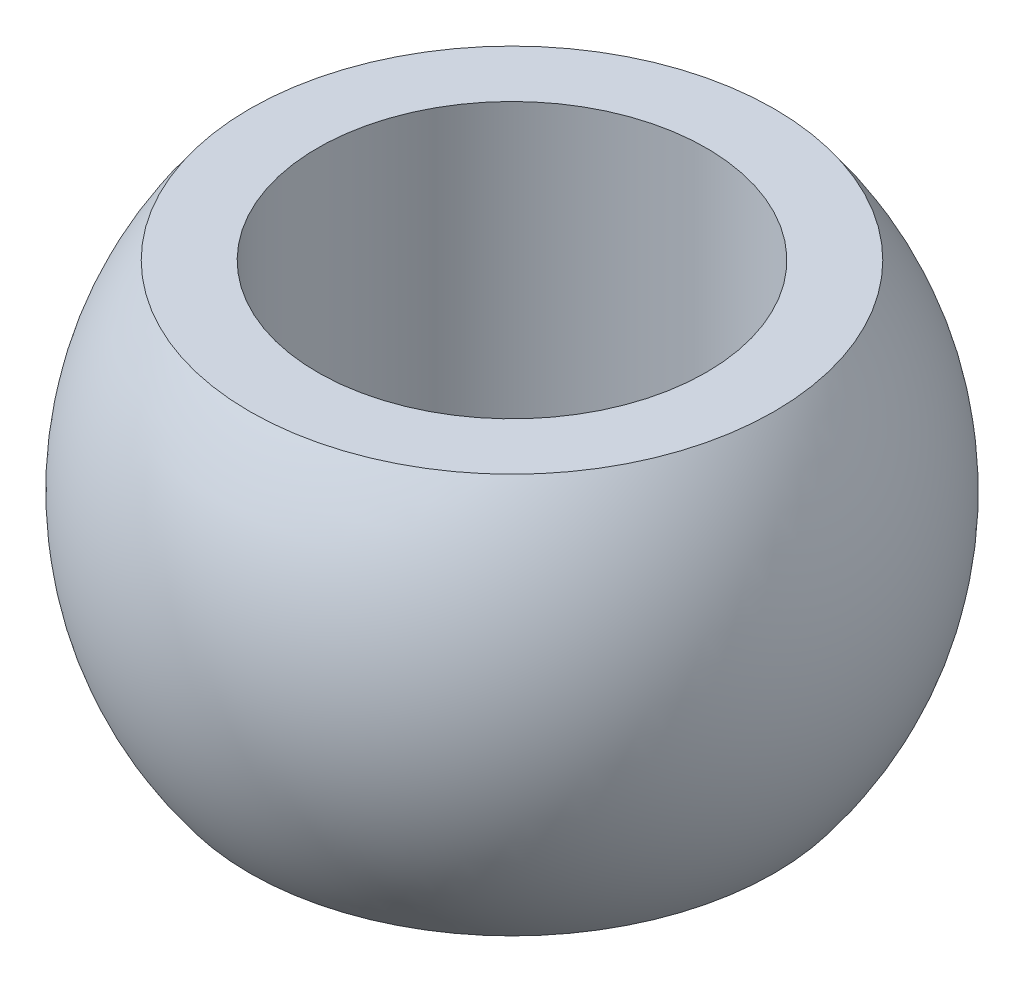
ISO-10303-21;
HEADER;
FILE_DESCRIPTION(('STEP AP214'),'2;1');
FILE_NAME('part.step','',(''),(''),'','','');
FILE_SCHEMA(('AUTOMOTIVE_DESIGN { 1 0 10303 214 1 1 1 1 }'));
ENDSEC;
DATA;
#1=APPLICATION_CONTEXT('core data for automotive mechanical design processes');
#2=APPLICATION_PROTOCOL_DEFINITION('international standard','automotive_design',2000,#1);
#3=PRODUCT_CONTEXT('',#1,'mechanical');
#4=PRODUCT('Part','Part','',(#3));
#5=PRODUCT_RELATED_PRODUCT_CATEGORY('part','',(#4));
#6=PRODUCT_DEFINITION_FORMATION('','',#4);
#7=PRODUCT_DEFINITION_CONTEXT('part definition',#1,'design');
#8=PRODUCT_DEFINITION('design','',#6,#7);
#9=PRODUCT_DEFINITION_SHAPE('','',#8);
#10=(LENGTH_UNIT() NAMED_UNIT(*) SI_UNIT(.MILLI.,.METRE.));
#11=(NAMED_UNIT(*) PLANE_ANGLE_UNIT() SI_UNIT($,.RADIAN.));
#12=(NAMED_UNIT(*) SI_UNIT($,.STERADIAN.) SOLID_ANGLE_UNIT());
#13=UNCERTAINTY_MEASURE_WITH_UNIT(LENGTH_MEASURE(1.E-05),#10,'distance_accuracy_value','');
#14=(GEOMETRIC_REPRESENTATION_CONTEXT(3) GLOBAL_UNCERTAINTY_ASSIGNED_CONTEXT((#13)) GLOBAL_UNIT_ASSIGNED_CONTEXT((#10,
#11,#12)) REPRESENTATION_CONTEXT('',''));
#15=CARTESIAN_POINT('',(0.,0.,0.));
#16=DIRECTION('',(0.,0.,1.));
#17=DIRECTION('',(1.,0.,0.));
#18=AXIS2_PLACEMENT_3D('',#15,#16,#17);
#19=CARTESIAN_POINT('',(0.,0.,0.));
#20=DIRECTION('',(0.,-1.,0.));
#21=DIRECTION('',(1.,0.,0.));
#22=AXIS2_PLACEMENT_3D('',#19,#20,#21);
#23=SPHERICAL_SURFACE('',#22,2.375);
#24=CARTESIAN_POINT('',(0.,1.44,0.));
#25=DIRECTION('',(0.,-1.,0.));
#26=DIRECTION('',(1.,0.,0.));
#27=AXIS2_PLACEMENT_3D('',#24,#25,#26);
#28=CIRCLE('',#27,1.88865693020199);
#29=CARTESIAN_POINT('',(1.88865693020199,1.44,0.));
#30=VERTEX_POINT('',#29);
#31=EDGE_CURVE('E42',#30,#30,#28,.T.);
#32=ORIENTED_EDGE('',*,*,#31,.T.);
#33=EDGE_LOOP('',(#32));
#34=FACE_BOUND('',#33,.T.);
#35=CARTESIAN_POINT('',(0.,-1.44,0.));
#36=DIRECTION('',(0.,-1.,0.));
#37=DIRECTION('',(1.,0.,0.));
#38=AXIS2_PLACEMENT_3D('',#35,#36,#37);
#39=CIRCLE('',#38,1.88865693020198);
#40=CARTESIAN_POINT('',(1.88865693020199,-1.43999999999999,0.));
#41=VERTEX_POINT('',#40);
#42=EDGE_CURVE('E10',#41,#41,#39,.T.);
#43=ORIENTED_EDGE('',*,*,#42,.F.);
#44=EDGE_LOOP('',(#43));
#45=FACE_BOUND('',#44,.T.);
#46=ADVANCED_FACE('F28',(#34,#45),#23,.T.);
#47=CARTESIAN_POINT('',(1.4,-1.44,0.));
#48=DIRECTION('',(0.,-1.,0.));
#49=DIRECTION('',(1.,0.,0.));
#50=AXIS2_PLACEMENT_3D('',#47,#48,#49);
#51=PLANE('',#50);
#52=ORIENTED_EDGE('',*,*,#42,.T.);
#53=EDGE_LOOP('',(#52));
#54=FACE_BOUND('',#53,.T.);
#55=CARTESIAN_POINT('',(0.,-1.44,0.));
#56=DIRECTION('',(0.,-1.,0.));
#57=DIRECTION('',(1.,0.,0.));
#58=AXIS2_PLACEMENT_3D('',#55,#56,#57);
#59=CIRCLE('',#58,1.4);
#60=CARTESIAN_POINT('',(1.4,-1.43999999999999,0.));
#61=VERTEX_POINT('',#60);
#62=EDGE_CURVE('E34',#61,#61,#59,.T.);
#63=ORIENTED_EDGE('',*,*,#62,.F.);
#64=EDGE_LOOP('',(#63));
#65=FACE_BOUND('',#64,.T.);
#66=ADVANCED_FACE('F58',(#54,#65),#51,.T.);
#67=CARTESIAN_POINT('',(1.56992341556154E-12,-449.643937115162,0.));
#68=DIRECTION('',(0.,-1.,0.));
#69=DIRECTION('',(1.,0.,0.));
#70=AXIS2_PLACEMENT_3D('',#67,#68,#69);
#71=CYLINDRICAL_SURFACE('',#70,1.4);
#72=ORIENTED_EDGE('',*,*,#62,.T.);
#73=EDGE_LOOP('',(#72));
#74=FACE_BOUND('',#73,.T.);
#75=CARTESIAN_POINT('',(0.,1.44,0.));
#76=DIRECTION('',(0.,-1.,0.));
#77=DIRECTION('',(1.,0.,0.));
#78=AXIS2_PLACEMENT_3D('',#75,#76,#77);
#79=CIRCLE('',#78,1.40000000000001);
#80=CARTESIAN_POINT('',(1.4,1.44,0.));
#81=VERTEX_POINT('',#80);
#82=EDGE_CURVE('E38',#81,#81,#79,.T.);
#83=ORIENTED_EDGE('',*,*,#82,.F.);
#84=EDGE_LOOP('',(#83));
#85=FACE_BOUND('',#84,.T.);
#86=ADVANCED_FACE('F52',(#74,#85),#71,.F.);
#87=CARTESIAN_POINT('',(1.88865693020199,1.44,0.));
#88=DIRECTION('',(0.,1.,0.));
#89=DIRECTION('',(-1.,0.,0.));
#90=AXIS2_PLACEMENT_3D('',#87,#88,#89);
#91=PLANE('',#90);
#92=ORIENTED_EDGE('',*,*,#82,.T.);
#93=EDGE_LOOP('',(#92));
#94=FACE_BOUND('',#93,.T.);
#95=ORIENTED_EDGE('',*,*,#31,.F.);
#96=EDGE_LOOP('',(#95));
#97=FACE_BOUND('',#96,.T.);
#98=ADVANCED_FACE('F50',(#94,#97),#91,.T.);
#99=CLOSED_SHELL('',(#46,#66,#86,#98));
#100=MANIFOLD_SOLID_BREP('B2',#99);
#101=ADVANCED_BREP_SHAPE_REPRESENTATION('',(#18,#100),#14);
#102=SHAPE_DEFINITION_REPRESENTATION(#9,#101);
ENDSEC;
END-ISO-10303-21;
